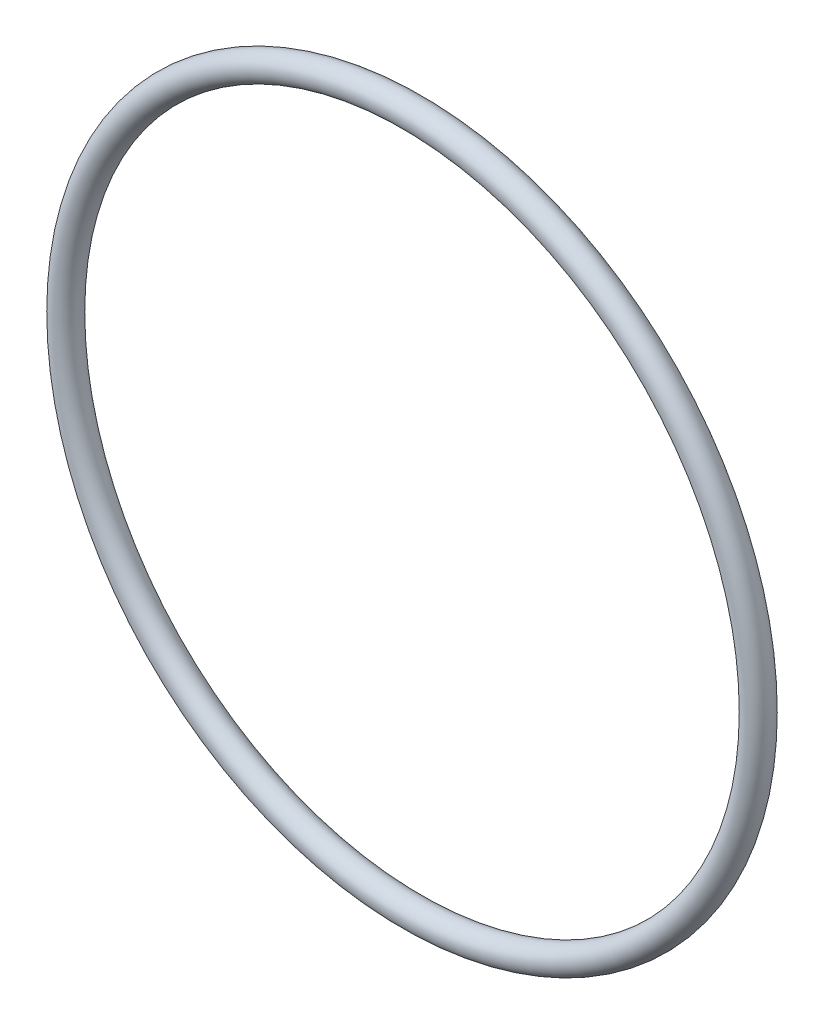
ISO-10303-21;
HEADER;
FILE_DESCRIPTION(('STEP AP214'),'2;1');
FILE_NAME('part.step','',(''),(''),'','','');
FILE_SCHEMA(('AUTOMOTIVE_DESIGN { 1 0 10303 214 1 1 1 1 }'));
ENDSEC;
DATA;
#1=APPLICATION_CONTEXT('core data for automotive mechanical design processes');
#2=APPLICATION_PROTOCOL_DEFINITION('international standard','automotive_design',2000,#1);
#3=PRODUCT_CONTEXT('',#1,'mechanical');
#4=PRODUCT('Part','Part','',(#3));
#5=PRODUCT_RELATED_PRODUCT_CATEGORY('part','',(#4));
#6=PRODUCT_DEFINITION_FORMATION('','',#4);
#7=PRODUCT_DEFINITION_CONTEXT('part definition',#1,'design');
#8=PRODUCT_DEFINITION('design','',#6,#7);
#9=PRODUCT_DEFINITION_SHAPE('','',#8);
#10=(LENGTH_UNIT() NAMED_UNIT(*) SI_UNIT(.MILLI.,.METRE.));
#11=(NAMED_UNIT(*) PLANE_ANGLE_UNIT() SI_UNIT($,.RADIAN.));
#12=(NAMED_UNIT(*) SI_UNIT($,.STERADIAN.) SOLID_ANGLE_UNIT());
#13=UNCERTAINTY_MEASURE_WITH_UNIT(LENGTH_MEASURE(1.E-05),#10,'distance_accuracy_value','');
#14=(GEOMETRIC_REPRESENTATION_CONTEXT(3) GLOBAL_UNCERTAINTY_ASSIGNED_CONTEXT((#13)) GLOBAL_UNIT_ASSIGNED_CONTEXT((#10,
#11,#12)) REPRESENTATION_CONTEXT('',''));
#15=CARTESIAN_POINT('',(0.,0.,0.));
#16=DIRECTION('',(0.,0.,1.));
#17=DIRECTION('',(1.,0.,0.));
#18=AXIS2_PLACEMENT_3D('',#15,#16,#17);
#19=CARTESIAN_POINT('',(0.,0.,0.));
#20=DIRECTION('',(0.,0.,1.));
#21=DIRECTION('',(1.,0.,0.));
#22=AXIS2_PLACEMENT_3D('',#19,#20,#21);
#23=TOROIDAL_SURFACE('',#22,33.6931,1.3081);
#24=CARTESIAN_POINT('',(35.0012,0.,0.));
#25=VERTEX_POINT('',#24);
#26=VERTEX_LOOP('',#25);
#27=FACE_BOUND('',#26,.T.);
#28=ADVANCED_FACE('F37',(#27),#23,.T.);
#29=CLOSED_SHELL('',(#28));
#30=MANIFOLD_SOLID_BREP('B2',#29);
#31=ADVANCED_BREP_SHAPE_REPRESENTATION('',(#18,#30),#14);
#32=SHAPE_DEFINITION_REPRESENTATION(#9,#31);
ENDSEC;
END-ISO-10303-21;
